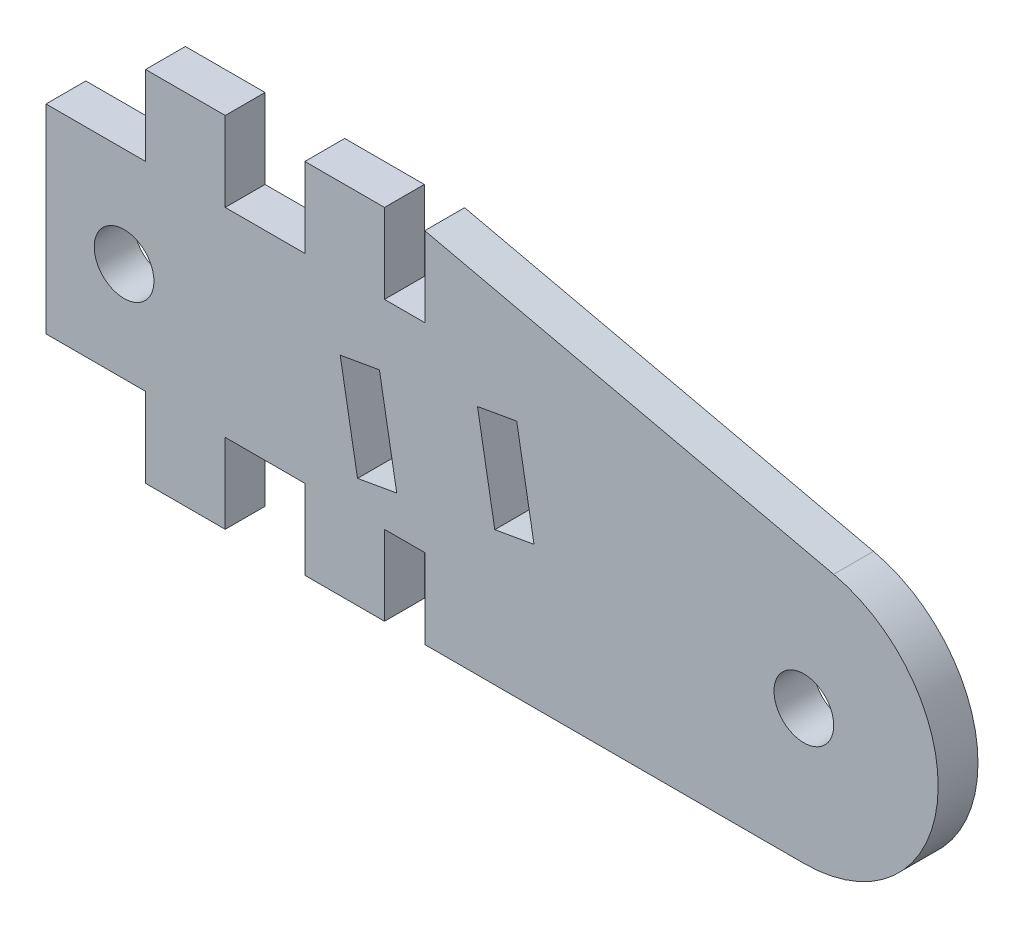
ISO-10303-21;
HEADER;
FILE_DESCRIPTION(('STEP AP214'),'2;1');
FILE_NAME('part.step','',(''),(''),'','','');
FILE_SCHEMA(('AUTOMOTIVE_DESIGN { 1 0 10303 214 1 1 1 1 }'));
ENDSEC;
DATA;
#1=APPLICATION_CONTEXT('core data for automotive mechanical design processes');
#2=APPLICATION_PROTOCOL_DEFINITION('international standard','automotive_design',2000,#1);
#3=PRODUCT_CONTEXT('',#1,'mechanical');
#4=PRODUCT('Part','Part','',(#3));
#5=PRODUCT_RELATED_PRODUCT_CATEGORY('part','',(#4));
#6=PRODUCT_DEFINITION_FORMATION('','',#4);
#7=PRODUCT_DEFINITION_CONTEXT('part definition',#1,'design');
#8=PRODUCT_DEFINITION('design','',#6,#7);
#9=PRODUCT_DEFINITION_SHAPE('','',#8);
#10=(LENGTH_UNIT() NAMED_UNIT(*) SI_UNIT(.MILLI.,.METRE.));
#11=(NAMED_UNIT(*) PLANE_ANGLE_UNIT() SI_UNIT($,.RADIAN.));
#12=(NAMED_UNIT(*) SI_UNIT($,.STERADIAN.) SOLID_ANGLE_UNIT());
#13=UNCERTAINTY_MEASURE_WITH_UNIT(LENGTH_MEASURE(1.E-05),#10,'distance_accuracy_value','');
#14=(GEOMETRIC_REPRESENTATION_CONTEXT(3) GLOBAL_UNCERTAINTY_ASSIGNED_CONTEXT((#13)) GLOBAL_UNIT_ASSIGNED_CONTEXT((#10,
#11,#12)) REPRESENTATION_CONTEXT('',''));
#15=CARTESIAN_POINT('',(0.,0.,0.));
#16=DIRECTION('',(0.,0.,1.));
#17=DIRECTION('',(1.,0.,0.));
#18=AXIS2_PLACEMENT_3D('',#15,#16,#17);
#19=CARTESIAN_POINT('',(38.05949585108,6.74534308282998,2.));
#20=DIRECTION('',(0.,0.,1.));
#21=DIRECTION('',(1.,0.,0.));
#22=AXIS2_PLACEMENT_3D('',#19,#20,#21);
#23=PLANE('',#22);
#24=CARTESIAN_POINT('',(3.92049009293526,8.99999999999998,2.));
#25=DIRECTION('',(0.,0.,1.));
#26=DIRECTION('',(1.,0.,0.));
#27=AXIS2_PLACEMENT_3D('',#24,#25,#26);
#28=CIRCLE('',#27,1.5);
#29=CARTESIAN_POINT('',(5.42049009293527,8.99999999999998,2.));
#30=VERTEX_POINT('',#29);
#31=EDGE_CURVE('E271',#30,#30,#28,.T.);
#32=ORIENTED_EDGE('',*,*,#31,.F.);
#33=EDGE_LOOP('',(#32));
#34=FACE_BOUND('',#33,.T.);
#35=DIRECTION('',(0.173648177666932,-0.984807753012208,0.));
#36=VECTOR('',#35,1.);
#37=CARTESIAN_POINT('',(14.7758795558328,10.4620193825306,2.));
#38=LINE('',#37,#36);
#39=CARTESIAN_POINT('',(14.7758795558328,10.4620193825306,2.));
#40=VERTEX_POINT('',#39);
#41=CARTESIAN_POINT('',(15.6441204441674,5.5379806174695,2.));
#42=VERTEX_POINT('',#41);
#43=EDGE_CURVE('E283',#40,#42,#38,.T.);
#44=ORIENTED_EDGE('',*,*,#43,.F.);
#45=DIRECTION('',(-0.984807753012208,-0.173648177666931,0.));
#46=VECTOR('',#45,1.);
#47=CARTESIAN_POINT('',(16.7454950618572,10.8093157378644,2.));
#48=LINE('',#47,#46);
#49=CARTESIAN_POINT('',(16.7454950618572,10.8093157378644,2.));
#50=VERTEX_POINT('',#49);
#51=EDGE_CURVE('E281',#50,#40,#48,.T.);
#52=ORIENTED_EDGE('',*,*,#51,.F.);
#53=DIRECTION('',(-0.173648177666932,0.984807753012208,0.));
#54=VECTOR('',#53,1.);
#55=CARTESIAN_POINT('',(16.7454950618572,10.8093157378644,2.));
#56=LINE('',#55,#54);
#57=CARTESIAN_POINT('',(17.6137359501918,5.88527697280338,2.));
#58=VERTEX_POINT('',#57);
#59=EDGE_CURVE('E289',#58,#50,#56,.T.);
#60=ORIENTED_EDGE('',*,*,#59,.F.);
#61=DIRECTION('',(0.984807753012206,0.173648177666941,0.));
#62=VECTOR('',#61,1.);
#63=CARTESIAN_POINT('',(15.6441204441674,5.5379806174695,2.));
#64=LINE('',#63,#62);
#65=EDGE_CURVE('E286',#42,#58,#64,.T.);
#66=ORIENTED_EDGE('',*,*,#65,.F.);
#67=EDGE_LOOP('',(#44,#52,#60,#66));
#68=FACE_BOUND('',#67,.T.);
#69=DIRECTION('',(0.,1.,0.));
#70=VECTOR('',#69,1.);
#71=CARTESIAN_POINT('',(9.,0.,2.));
#72=LINE('',#71,#70);
#73=CARTESIAN_POINT('',(9.,0.,2.));
#74=VERTEX_POINT('',#73);
#75=CARTESIAN_POINT('',(9.,4.,2.));
#76=VERTEX_POINT('',#75);
#77=EDGE_CURVE('E312',#74,#76,#72,.T.);
#78=ORIENTED_EDGE('',*,*,#77,.T.);
#79=DIRECTION('',(1.,0.,0.));
#80=VECTOR('',#79,1.);
#81=CARTESIAN_POINT('',(9.,4.,2.));
#82=LINE('',#81,#80);
#83=CARTESIAN_POINT('',(13.,4.,2.));
#84=VERTEX_POINT('',#83);
#85=EDGE_CURVE('E315',#76,#84,#82,.T.);
#86=ORIENTED_EDGE('',*,*,#85,.T.);
#87=DIRECTION('',(0.,-1.,0.));
#88=VECTOR('',#87,1.);
#89=CARTESIAN_POINT('',(13.,4.,2.));
#90=LINE('',#89,#88);
#91=CARTESIAN_POINT('',(13.,0.,2.));
#92=VERTEX_POINT('',#91);
#93=EDGE_CURVE('E318',#84,#92,#90,.T.);
#94=ORIENTED_EDGE('',*,*,#93,.T.);
#95=DIRECTION('',(1.,0.,0.));
#96=VECTOR('',#95,1.);
#97=CARTESIAN_POINT('',(13.,0.,2.));
#98=LINE('',#97,#96);
#99=CARTESIAN_POINT('',(17.,0.,2.));
#100=VERTEX_POINT('',#99);
#101=EDGE_CURVE('E320',#92,#100,#98,.T.);
#102=ORIENTED_EDGE('',*,*,#101,.T.);
#103=DIRECTION('',(0.,1.,0.));
#104=VECTOR('',#103,1.);
#105=CARTESIAN_POINT('',(17.,0.,2.));
#106=LINE('',#105,#104);
#107=CARTESIAN_POINT('',(17.,4.,2.));
#108=VERTEX_POINT('',#107);
#109=EDGE_CURVE('E322',#100,#108,#106,.T.);
#110=ORIENTED_EDGE('',*,*,#109,.T.);
#111=DIRECTION('',(1.,0.,0.));
#112=VECTOR('',#111,1.);
#113=CARTESIAN_POINT('',(17.,4.,2.));
#114=LINE('',#113,#112);
#115=CARTESIAN_POINT('',(19.0215619335038,4.,2.));
#116=VERTEX_POINT('',#115);
#117=EDGE_CURVE('E324',#108,#116,#114,.T.);
#118=ORIENTED_EDGE('',*,*,#117,.T.);
#119=DIRECTION('',(0.,-1.,0.));
#120=VECTOR('',#119,1.);
#121=CARTESIAN_POINT('',(19.0215619335038,4.,2.));
#122=LINE('',#121,#120);
#123=CARTESIAN_POINT('',(19.0215619335038,0.,2.));
#124=VERTEX_POINT('',#123);
#125=EDGE_CURVE('E326',#116,#124,#122,.T.);
#126=ORIENTED_EDGE('',*,*,#125,.T.);
#127=DIRECTION('',(1.,0.,0.));
#128=VECTOR('',#127,1.);
#129=CARTESIAN_POINT('',(19.0215619335038,0.,2.));
#130=LINE('',#129,#128);
#131=CARTESIAN_POINT('',(38.05949585108,0.,2.));
#132=VERTEX_POINT('',#131);
#133=EDGE_CURVE('E328',#124,#132,#130,.T.);
#134=ORIENTED_EDGE('',*,*,#133,.T.);
#135=CARTESIAN_POINT('',(38.05949585108,6.74534308282998,2.));
#136=DIRECTION('',(0.,0.,1.));
#137=DIRECTION('',(1.,0.,0.));
#138=AXIS2_PLACEMENT_3D('',#135,#136,#137);
#139=CIRCLE('',#138,6.74534308282998);
#140=CARTESIAN_POINT('',(39.5575990260467,13.3222222958182,2.));
#141=VERTEX_POINT('',#140);
#142=EDGE_CURVE('E330',#132,#141,#139,.T.);
#143=ORIENTED_EDGE('',*,*,#142,.T.);
#144=DIRECTION('',(-0.97502515916936,0.22209443709099,0.));
#145=VECTOR('',#144,1.);
#146=CARTESIAN_POINT('',(19.0215619335039,17.9999883567818,2.));
#147=LINE('',#146,#145);
#148=CARTESIAN_POINT('',(19.0215619335039,17.9999883567818,2.));
#149=VERTEX_POINT('',#148);
#150=EDGE_CURVE('E332',#141,#149,#147,.T.);
#151=ORIENTED_EDGE('',*,*,#150,.T.);
#152=DIRECTION('',(0.,-1.,0.));
#153=VECTOR('',#152,1.);
#154=CARTESIAN_POINT('',(19.0215619335038,13.9999883567817,2.));
#155=LINE('',#154,#153);
#156=CARTESIAN_POINT('',(19.0215619335038,13.9999883567817,2.));
#157=VERTEX_POINT('',#156);
#158=EDGE_CURVE('E334',#149,#157,#155,.T.);
#159=ORIENTED_EDGE('',*,*,#158,.T.);
#160=DIRECTION('',(-1.,0.,0.));
#161=VECTOR('',#160,1.);
#162=CARTESIAN_POINT('',(17.,13.9999883567817,2.));
#163=LINE('',#162,#161);
#164=CARTESIAN_POINT('',(17.,13.9999883567817,2.));
#165=VERTEX_POINT('',#164);
#166=EDGE_CURVE('E336',#157,#165,#163,.T.);
#167=ORIENTED_EDGE('',*,*,#166,.T.);
#168=DIRECTION('',(0.,1.,0.));
#169=VECTOR('',#168,1.);
#170=CARTESIAN_POINT('',(17.,17.9999883567817,2.));
#171=LINE('',#170,#169);
#172=CARTESIAN_POINT('',(17.,17.9999883567817,2.));
#173=VERTEX_POINT('',#172);
#174=EDGE_CURVE('E338',#165,#173,#171,.T.);
#175=ORIENTED_EDGE('',*,*,#174,.T.);
#176=DIRECTION('',(-1.,0.,0.));
#177=VECTOR('',#176,1.);
#178=CARTESIAN_POINT('',(13.,17.9999883567817,2.));
#179=LINE('',#178,#177);
#180=CARTESIAN_POINT('',(13.,17.9999883567817,2.));
#181=VERTEX_POINT('',#180);
#182=EDGE_CURVE('E340',#173,#181,#179,.T.);
#183=ORIENTED_EDGE('',*,*,#182,.T.);
#184=DIRECTION('',(0.,-1.,0.));
#185=VECTOR('',#184,1.);
#186=CARTESIAN_POINT('',(13.,13.9999883567817,2.));
#187=LINE('',#186,#185);
#188=CARTESIAN_POINT('',(13.,13.9999883567817,2.));
#189=VERTEX_POINT('',#188);
#190=EDGE_CURVE('E342',#181,#189,#187,.T.);
#191=ORIENTED_EDGE('',*,*,#190,.T.);
#192=DIRECTION('',(-1.,0.,0.));
#193=VECTOR('',#192,1.);
#194=CARTESIAN_POINT('',(9.,13.9999883567817,2.));
#195=LINE('',#194,#193);
#196=CARTESIAN_POINT('',(9.,13.9999883567817,2.));
#197=VERTEX_POINT('',#196);
#198=EDGE_CURVE('E344',#189,#197,#195,.T.);
#199=ORIENTED_EDGE('',*,*,#198,.T.);
#200=DIRECTION('',(0.,1.,0.));
#201=VECTOR('',#200,1.);
#202=CARTESIAN_POINT('',(9.,17.9999883567817,2.));
#203=LINE('',#202,#201);
#204=CARTESIAN_POINT('',(9.,17.9999883567817,2.));
#205=VERTEX_POINT('',#204);
#206=EDGE_CURVE('E346',#197,#205,#203,.T.);
#207=ORIENTED_EDGE('',*,*,#206,.T.);
#208=DIRECTION('',(-1.,0.,0.));
#209=VECTOR('',#208,1.);
#210=CARTESIAN_POINT('',(5.,17.9999883567817,2.));
#211=LINE('',#210,#209);
#212=CARTESIAN_POINT('',(5.,17.9999883567817,2.));
#213=VERTEX_POINT('',#212);
#214=EDGE_CURVE('E348',#205,#213,#211,.T.);
#215=ORIENTED_EDGE('',*,*,#214,.T.);
#216=DIRECTION('',(0.,-1.,0.));
#217=VECTOR('',#216,1.);
#218=CARTESIAN_POINT('',(5.,13.9999883567817,2.));
#219=LINE('',#218,#217);
#220=CARTESIAN_POINT('',(5.,13.9999883567817,2.));
#221=VERTEX_POINT('',#220);
#222=EDGE_CURVE('E350',#213,#221,#219,.T.);
#223=ORIENTED_EDGE('',*,*,#222,.T.);
#224=DIRECTION('',(-1.,0.,0.));
#225=VECTOR('',#224,1.);
#226=CARTESIAN_POINT('',(5.,13.9999883567817,2.));
#227=LINE('',#226,#225);
#228=CARTESIAN_POINT('',(0.,13.9999883567817,2.));
#229=VERTEX_POINT('',#228);
#230=EDGE_CURVE('E352',#221,#229,#227,.T.);
#231=ORIENTED_EDGE('',*,*,#230,.T.);
#232=DIRECTION('',(0.,-1.,0.));
#233=VECTOR('',#232,1.);
#234=CARTESIAN_POINT('',(0.,13.9999883567817,2.));
#235=LINE('',#234,#233);
#236=CARTESIAN_POINT('',(0.,4.,2.));
#237=VERTEX_POINT('',#236);
#238=EDGE_CURVE('E354',#229,#237,#235,.T.);
#239=ORIENTED_EDGE('',*,*,#238,.T.);
#240=DIRECTION('',(1.,0.,0.));
#241=VECTOR('',#240,1.);
#242=CARTESIAN_POINT('',(0.,4.,2.));
#243=LINE('',#242,#241);
#244=CARTESIAN_POINT('',(5.,4.,2.));
#245=VERTEX_POINT('',#244);
#246=EDGE_CURVE('E356',#237,#245,#243,.T.);
#247=ORIENTED_EDGE('',*,*,#246,.T.);
#248=DIRECTION('',(0.,-1.,0.));
#249=VECTOR('',#248,1.);
#250=CARTESIAN_POINT('',(5.,4.,2.));
#251=LINE('',#250,#249);
#252=CARTESIAN_POINT('',(5.,0.,2.));
#253=VERTEX_POINT('',#252);
#254=EDGE_CURVE('E358',#245,#253,#251,.T.);
#255=ORIENTED_EDGE('',*,*,#254,.T.);
#256=DIRECTION('',(1.,0.,0.));
#257=VECTOR('',#256,1.);
#258=CARTESIAN_POINT('',(5.,0.,2.));
#259=LINE('',#258,#257);
#260=EDGE_CURVE('E360',#253,#74,#259,.T.);
#261=ORIENTED_EDGE('',*,*,#260,.T.);
#262=EDGE_LOOP('',(#78,#86,#94,#102,#110,#118,#126,#134,#143,#151,#159,#167,#175,#183,#191,#199,
#207,#215,#223,#231,#239,#247,#255,#261));
#263=FACE_BOUND('',#262,.T.);
#264=DIRECTION('',(-0.984807753012208,-0.173648177666933,0.));
#265=VECTOR('',#264,1.);
#266=CARTESIAN_POINT('',(23.6391493329428,12.024852981533,2.));
#267=LINE('',#266,#265);
#268=CARTESIAN_POINT('',(23.6391493329428,12.024852981533,2.));
#269=VERTEX_POINT('',#268);
#270=CARTESIAN_POINT('',(21.6695338269183,11.6775566261991,2.));
#271=VERTEX_POINT('',#270);
#272=EDGE_CURVE('E250',#269,#271,#267,.T.);
#273=ORIENTED_EDGE('',*,*,#272,.F.);
#274=DIRECTION('',(-0.173648177666932,0.984807753012208,0.));
#275=VECTOR('',#274,1.);
#276=CARTESIAN_POINT('',(23.6391493329428,12.024852981533,2.));
#277=LINE('',#276,#275);
#278=CARTESIAN_POINT('',(24.5073902212774,7.10081421647191,2.));
#279=VERTEX_POINT('',#278);
#280=EDGE_CURVE('E242',#279,#269,#277,.T.);
#281=ORIENTED_EDGE('',*,*,#280,.F.);
#282=DIRECTION('',(0.984807753012208,0.173648177666932,0.));
#283=VECTOR('',#282,1.);
#284=CARTESIAN_POINT('',(22.537774715253,6.75351786113804,2.));
#285=LINE('',#284,#283);
#286=CARTESIAN_POINT('',(22.537774715253,6.75351786113804,2.));
#287=VERTEX_POINT('',#286);
#288=EDGE_CURVE('E265',#287,#279,#285,.T.);
#289=ORIENTED_EDGE('',*,*,#288,.F.);
#290=DIRECTION('',(0.173648177666932,-0.984807753012208,0.));
#291=VECTOR('',#290,1.);
#292=CARTESIAN_POINT('',(21.6695338269183,11.6775566261991,2.));
#293=LINE('',#292,#291);
#294=EDGE_CURVE('E263',#271,#287,#293,.T.);
#295=ORIENTED_EDGE('',*,*,#294,.F.);
#296=EDGE_LOOP('',(#273,#281,#289,#295));
#297=FACE_BOUND('',#296,.T.);
#298=CARTESIAN_POINT('',(38.05949585108,6.74534308282998,2.));
#299=DIRECTION('',(0.,0.,1.));
#300=DIRECTION('',(1.,0.,0.));
#301=AXIS2_PLACEMENT_3D('',#298,#299,#300);
#302=CIRCLE('',#301,1.5);
#303=CARTESIAN_POINT('',(39.55949585108,6.74534308282998,2.));
#304=VERTEX_POINT('',#303);
#305=EDGE_CURVE('E904',#304,#304,#302,.T.);
#306=ORIENTED_EDGE('',*,*,#305,.F.);
#307=EDGE_LOOP('',(#306));
#308=FACE_BOUND('',#307,.T.);
#309=ADVANCED_FACE('F33',(#34,#68,#263,#297,#308),#23,.T.);
#310=CARTESIAN_POINT('',(38.05949585108,6.74534308282998,0.));
#311=DIRECTION('',(0.,0.,1.));
#312=DIRECTION('',(1.,0.,0.));
#313=AXIS2_PLACEMENT_3D('',#310,#311,#312);
#314=PLANE('',#313);
#315=CARTESIAN_POINT('',(3.92049009293526,8.99999999999998,0.));
#316=DIRECTION('',(0.,0.,1.));
#317=DIRECTION('',(1.,0.,0.));
#318=AXIS2_PLACEMENT_3D('',#315,#316,#317);
#319=CIRCLE('',#318,1.5);
#320=CARTESIAN_POINT('',(5.42049009293527,8.99999999999998,0.));
#321=VERTEX_POINT('',#320);
#322=EDGE_CURVE('E910',#321,#321,#319,.T.);
#323=ORIENTED_EDGE('',*,*,#322,.T.);
#324=EDGE_LOOP('',(#323));
#325=FACE_BOUND('',#324,.T.);
#326=DIRECTION('',(-0.984807753012208,-0.173648177666931,0.));
#327=VECTOR('',#326,1.);
#328=CARTESIAN_POINT('',(16.7454950618572,10.8093157378644,0.));
#329=LINE('',#328,#327);
#330=CARTESIAN_POINT('',(16.7454950618572,10.8093157378644,0.));
#331=VERTEX_POINT('',#330);
#332=CARTESIAN_POINT('',(14.7758795558328,10.4620193825306,0.));
#333=VERTEX_POINT('',#332);
#334=EDGE_CURVE('E258',#331,#333,#329,.T.);
#335=ORIENTED_EDGE('',*,*,#334,.T.);
#336=DIRECTION('',(0.173648177666932,-0.984807753012208,0.));
#337=VECTOR('',#336,1.);
#338=CARTESIAN_POINT('',(14.7758795558328,10.4620193825306,0.));
#339=LINE('',#338,#337);
#340=CARTESIAN_POINT('',(15.6441204441674,5.5379806174695,0.));
#341=VERTEX_POINT('',#340);
#342=EDGE_CURVE('E294',#333,#341,#339,.T.);
#343=ORIENTED_EDGE('',*,*,#342,.T.);
#344=DIRECTION('',(0.984807753012206,0.173648177666941,0.));
#345=VECTOR('',#344,1.);
#346=CARTESIAN_POINT('',(15.6441204441674,5.5379806174695,0.));
#347=LINE('',#346,#345);
#348=CARTESIAN_POINT('',(17.6137359501918,5.88527697280338,0.));
#349=VERTEX_POINT('',#348);
#350=EDGE_CURVE('E297',#341,#349,#347,.T.);
#351=ORIENTED_EDGE('',*,*,#350,.T.);
#352=DIRECTION('',(-0.173648177666932,0.984807753012208,0.));
#353=VECTOR('',#352,1.);
#354=CARTESIAN_POINT('',(16.7454950618572,10.8093157378644,0.));
#355=LINE('',#354,#353);
#356=EDGE_CURVE('E284',#349,#331,#355,.T.);
#357=ORIENTED_EDGE('',*,*,#356,.T.);
#358=EDGE_LOOP('',(#335,#343,#351,#357));
#359=FACE_BOUND('',#358,.T.);
#360=DIRECTION('',(0.,1.,0.));
#361=VECTOR('',#360,1.);
#362=CARTESIAN_POINT('',(9.,0.,0.));
#363=LINE('',#362,#361);
#364=CARTESIAN_POINT('',(9.,0.,0.));
#365=VERTEX_POINT('',#364);
#366=CARTESIAN_POINT('',(9.,4.,0.));
#367=VERTEX_POINT('',#366);
#368=EDGE_CURVE('E311',#365,#367,#363,.T.);
#369=ORIENTED_EDGE('',*,*,#368,.F.);
#370=DIRECTION('',(1.,0.,0.));
#371=VECTOR('',#370,1.);
#372=CARTESIAN_POINT('',(5.,0.,0.));
#373=LINE('',#372,#371);
#374=CARTESIAN_POINT('',(5.,0.,0.));
#375=VERTEX_POINT('',#374);
#376=EDGE_CURVE('E316',#375,#365,#373,.T.);
#377=ORIENTED_EDGE('',*,*,#376,.F.);
#378=DIRECTION('',(0.,-1.,0.));
#379=VECTOR('',#378,1.);
#380=CARTESIAN_POINT('',(5.,4.,0.));
#381=LINE('',#380,#379);
#382=CARTESIAN_POINT('',(5.,4.,0.));
#383=VERTEX_POINT('',#382);
#384=EDGE_CURVE('E407',#383,#375,#381,.T.);
#385=ORIENTED_EDGE('',*,*,#384,.F.);
#386=DIRECTION('',(1.,0.,0.));
#387=VECTOR('',#386,1.);
#388=CARTESIAN_POINT('',(0.,4.,0.));
#389=LINE('',#388,#387);
#390=CARTESIAN_POINT('',(0.,4.,0.));
#391=VERTEX_POINT('',#390);
#392=EDGE_CURVE('E405',#391,#383,#389,.T.);
#393=ORIENTED_EDGE('',*,*,#392,.F.);
#394=DIRECTION('',(0.,-1.,0.));
#395=VECTOR('',#394,1.);
#396=CARTESIAN_POINT('',(0.,13.9999883567817,0.));
#397=LINE('',#396,#395);
#398=CARTESIAN_POINT('',(0.,13.9999883567817,0.));
#399=VERTEX_POINT('',#398);
#400=EDGE_CURVE('E403',#399,#391,#397,.T.);
#401=ORIENTED_EDGE('',*,*,#400,.F.);
#402=DIRECTION('',(-1.,0.,0.));
#403=VECTOR('',#402,1.);
#404=CARTESIAN_POINT('',(5.,13.9999883567817,0.));
#405=LINE('',#404,#403);
#406=CARTESIAN_POINT('',(5.,13.9999883567817,0.));
#407=VERTEX_POINT('',#406);
#408=EDGE_CURVE('E401',#407,#399,#405,.T.);
#409=ORIENTED_EDGE('',*,*,#408,.F.);
#410=DIRECTION('',(0.,-1.,0.));
#411=VECTOR('',#410,1.);
#412=CARTESIAN_POINT('',(5.,13.9999883567817,0.));
#413=LINE('',#412,#411);
#414=CARTESIAN_POINT('',(5.,17.9999883567817,0.));
#415=VERTEX_POINT('',#414);
#416=EDGE_CURVE('E399',#415,#407,#413,.T.);
#417=ORIENTED_EDGE('',*,*,#416,.F.);
#418=DIRECTION('',(-1.,0.,0.));
#419=VECTOR('',#418,1.);
#420=CARTESIAN_POINT('',(5.,17.9999883567817,0.));
#421=LINE('',#420,#419);
#422=CARTESIAN_POINT('',(9.,17.9999883567817,0.));
#423=VERTEX_POINT('',#422);
#424=EDGE_CURVE('E397',#423,#415,#421,.T.);
#425=ORIENTED_EDGE('',*,*,#424,.F.);
#426=DIRECTION('',(0.,1.,0.));
#427=VECTOR('',#426,1.);
#428=CARTESIAN_POINT('',(9.,17.9999883567817,0.));
#429=LINE('',#428,#427);
#430=CARTESIAN_POINT('',(9.,13.9999883567817,0.));
#431=VERTEX_POINT('',#430);
#432=EDGE_CURVE('E395',#431,#423,#429,.T.);
#433=ORIENTED_EDGE('',*,*,#432,.F.);
#434=DIRECTION('',(-1.,0.,0.));
#435=VECTOR('',#434,1.);
#436=CARTESIAN_POINT('',(9.,13.9999883567817,0.));
#437=LINE('',#436,#435);
#438=CARTESIAN_POINT('',(13.,13.9999883567817,0.));
#439=VERTEX_POINT('',#438);
#440=EDGE_CURVE('E393',#439,#431,#437,.T.);
#441=ORIENTED_EDGE('',*,*,#440,.F.);
#442=DIRECTION('',(0.,-1.,0.));
#443=VECTOR('',#442,1.);
#444=CARTESIAN_POINT('',(13.,13.9999883567817,0.));
#445=LINE('',#444,#443);
#446=CARTESIAN_POINT('',(13.,17.9999883567817,0.));
#447=VERTEX_POINT('',#446);
#448=EDGE_CURVE('E391',#447,#439,#445,.T.);
#449=ORIENTED_EDGE('',*,*,#448,.F.);
#450=DIRECTION('',(-1.,0.,0.));
#451=VECTOR('',#450,1.);
#452=CARTESIAN_POINT('',(13.,17.9999883567817,0.));
#453=LINE('',#452,#451);
#454=CARTESIAN_POINT('',(17.,17.9999883567817,0.));
#455=VERTEX_POINT('',#454);
#456=EDGE_CURVE('E389',#455,#447,#453,.T.);
#457=ORIENTED_EDGE('',*,*,#456,.F.);
#458=DIRECTION('',(0.,1.,0.));
#459=VECTOR('',#458,1.);
#460=CARTESIAN_POINT('',(17.,17.9999883567817,0.));
#461=LINE('',#460,#459);
#462=CARTESIAN_POINT('',(17.,13.9999883567817,0.));
#463=VERTEX_POINT('',#462);
#464=EDGE_CURVE('E387',#463,#455,#461,.T.);
#465=ORIENTED_EDGE('',*,*,#464,.F.);
#466=DIRECTION('',(-1.,0.,0.));
#467=VECTOR('',#466,1.);
#468=CARTESIAN_POINT('',(17.,13.9999883567817,0.));
#469=LINE('',#468,#467);
#470=CARTESIAN_POINT('',(19.0215619335038,13.9999883567817,0.));
#471=VERTEX_POINT('',#470);
#472=EDGE_CURVE('E385',#471,#463,#469,.T.);
#473=ORIENTED_EDGE('',*,*,#472,.F.);
#474=DIRECTION('',(0.,-1.,0.));
#475=VECTOR('',#474,1.);
#476=CARTESIAN_POINT('',(19.0215619335038,13.9999883567817,0.));
#477=LINE('',#476,#475);
#478=CARTESIAN_POINT('',(19.0215619335039,17.9999883567818,0.));
#479=VERTEX_POINT('',#478);
#480=EDGE_CURVE('E383',#479,#471,#477,.T.);
#481=ORIENTED_EDGE('',*,*,#480,.F.);
#482=DIRECTION('',(-0.97502515916936,0.22209443709099,0.));
#483=VECTOR('',#482,1.);
#484=CARTESIAN_POINT('',(19.0215619335039,17.9999883567818,0.));
#485=LINE('',#484,#483);
#486=CARTESIAN_POINT('',(39.5575990260467,13.3222222958182,0.));
#487=VERTEX_POINT('',#486);
#488=EDGE_CURVE('E381',#487,#479,#485,.T.);
#489=ORIENTED_EDGE('',*,*,#488,.F.);
#490=CARTESIAN_POINT('',(38.05949585108,6.74534308282998,0.));
#491=DIRECTION('',(0.,0.,1.));
#492=DIRECTION('',(1.,0.,0.));
#493=AXIS2_PLACEMENT_3D('',#490,#491,#492);
#494=CIRCLE('',#493,6.74534308282998);
#495=CARTESIAN_POINT('',(38.05949585108,0.,0.));
#496=VERTEX_POINT('',#495);
#497=EDGE_CURVE('E379',#496,#487,#494,.T.);
#498=ORIENTED_EDGE('',*,*,#497,.F.);
#499=DIRECTION('',(1.,0.,0.));
#500=VECTOR('',#499,1.);
#501=CARTESIAN_POINT('',(19.0215619335038,0.,0.));
#502=LINE('',#501,#500);
#503=CARTESIAN_POINT('',(19.0215619335038,0.,0.));
#504=VERTEX_POINT('',#503);
#505=EDGE_CURVE('E377',#504,#496,#502,.T.);
#506=ORIENTED_EDGE('',*,*,#505,.F.);
#507=DIRECTION('',(0.,-1.,0.));
#508=VECTOR('',#507,1.);
#509=CARTESIAN_POINT('',(19.0215619335038,4.,0.));
#510=LINE('',#509,#508);
#511=CARTESIAN_POINT('',(19.0215619335038,4.,0.));
#512=VERTEX_POINT('',#511);
#513=EDGE_CURVE('E375',#512,#504,#510,.T.);
#514=ORIENTED_EDGE('',*,*,#513,.F.);
#515=DIRECTION('',(1.,0.,0.));
#516=VECTOR('',#515,1.);
#517=CARTESIAN_POINT('',(17.,4.,0.));
#518=LINE('',#517,#516);
#519=CARTESIAN_POINT('',(17.,4.,0.));
#520=VERTEX_POINT('',#519);
#521=EDGE_CURVE('E373',#520,#512,#518,.T.);
#522=ORIENTED_EDGE('',*,*,#521,.F.);
#523=DIRECTION('',(0.,1.,0.));
#524=VECTOR('',#523,1.);
#525=CARTESIAN_POINT('',(17.,0.,0.));
#526=LINE('',#525,#524);
#527=CARTESIAN_POINT('',(17.,0.,0.));
#528=VERTEX_POINT('',#527);
#529=EDGE_CURVE('E371',#528,#520,#526,.T.);
#530=ORIENTED_EDGE('',*,*,#529,.F.);
#531=DIRECTION('',(1.,0.,0.));
#532=VECTOR('',#531,1.);
#533=CARTESIAN_POINT('',(13.,0.,0.));
#534=LINE('',#533,#532);
#535=CARTESIAN_POINT('',(13.,0.,0.));
#536=VERTEX_POINT('',#535);
#537=EDGE_CURVE('E369',#536,#528,#534,.T.);
#538=ORIENTED_EDGE('',*,*,#537,.F.);
#539=DIRECTION('',(0.,-1.,0.));
#540=VECTOR('',#539,1.);
#541=CARTESIAN_POINT('',(13.,4.,0.));
#542=LINE('',#541,#540);
#543=CARTESIAN_POINT('',(13.,4.,0.));
#544=VERTEX_POINT('',#543);
#545=EDGE_CURVE('E367',#544,#536,#542,.T.);
#546=ORIENTED_EDGE('',*,*,#545,.F.);
#547=DIRECTION('',(1.,0.,0.));
#548=VECTOR('',#547,1.);
#549=CARTESIAN_POINT('',(9.,4.,0.));
#550=LINE('',#549,#548);
#551=EDGE_CURVE('E365',#367,#544,#550,.T.);
#552=ORIENTED_EDGE('',*,*,#551,.F.);
#553=EDGE_LOOP('',(#369,#377,#385,#393,#401,#409,#417,#425,#433,#441,#449,#457,#465,#473,#481,
#489,#498,#506,#514,#522,#530,#538,#546,#552));
#554=FACE_BOUND('',#553,.T.);
#555=DIRECTION('',(-0.173648177666932,0.984807753012208,0.));
#556=VECTOR('',#555,1.);
#557=CARTESIAN_POINT('',(23.6391493329428,12.024852981533,0.));
#558=LINE('',#557,#556);
#559=CARTESIAN_POINT('',(24.5073902212774,7.10081421647191,0.));
#560=VERTEX_POINT('',#559);
#561=CARTESIAN_POINT('',(23.6391493329428,12.024852981533,0.));
#562=VERTEX_POINT('',#561);
#563=EDGE_CURVE('E56',#560,#562,#558,.T.);
#564=ORIENTED_EDGE('',*,*,#563,.T.);
#565=DIRECTION('',(-0.984807753012208,-0.173648177666933,0.));
#566=VECTOR('',#565,1.);
#567=CARTESIAN_POINT('',(23.6391493329428,12.024852981533,0.));
#568=LINE('',#567,#566);
#569=CARTESIAN_POINT('',(21.6695338269183,11.6775566261991,0.));
#570=VERTEX_POINT('',#569);
#571=EDGE_CURVE('E257',#562,#570,#568,.T.);
#572=ORIENTED_EDGE('',*,*,#571,.T.);
#573=DIRECTION('',(0.173648177666932,-0.984807753012208,0.));
#574=VECTOR('',#573,1.);
#575=CARTESIAN_POINT('',(21.6695338269183,11.6775566261991,0.));
#576=LINE('',#575,#574);
#577=CARTESIAN_POINT('',(22.537774715253,6.75351786113804,0.));
#578=VERTEX_POINT('',#577);
#579=EDGE_CURVE('E273',#570,#578,#576,.T.);
#580=ORIENTED_EDGE('',*,*,#579,.T.);
#581=DIRECTION('',(0.984807753012208,0.173648177666932,0.));
#582=VECTOR('',#581,1.);
#583=CARTESIAN_POINT('',(22.537774715253,6.75351786113804,0.));
#584=LINE('',#583,#582);
#585=EDGE_CURVE('E251',#578,#560,#584,.T.);
#586=ORIENTED_EDGE('',*,*,#585,.T.);
#587=EDGE_LOOP('',(#564,#572,#580,#586));
#588=FACE_BOUND('',#587,.T.);
#589=CARTESIAN_POINT('',(38.05949585108,6.74534308282998,0.));
#590=DIRECTION('',(0.,0.,1.));
#591=DIRECTION('',(1.,0.,0.));
#592=AXIS2_PLACEMENT_3D('',#589,#590,#591);
#593=CIRCLE('',#592,1.5);
#594=CARTESIAN_POINT('',(39.55949585108,6.74534308282998,0.));
#595=VERTEX_POINT('',#594);
#596=EDGE_CURVE('E907',#595,#595,#593,.T.);
#597=ORIENTED_EDGE('',*,*,#596,.T.);
#598=EDGE_LOOP('',(#597));
#599=FACE_BOUND('',#598,.T.);
#600=ADVANCED_FACE('F485',(#325,#359,#554,#588,#599),#314,.F.);
#601=CARTESIAN_POINT('',(9.,0.,2.));
#602=DIRECTION('',(-1.,0.,0.));
#603=DIRECTION('',(0.,0.,1.));
#604=AXIS2_PLACEMENT_3D('',#601,#602,#603);
#605=PLANE('',#604);
#606=ORIENTED_EDGE('',*,*,#368,.T.);
#607=DIRECTION('',(0.,0.,-1.));
#608=VECTOR('',#607,1.);
#609=CARTESIAN_POINT('',(9.,4.,2.));
#610=LINE('',#609,#608);
#611=EDGE_CURVE('E11',#76,#367,#610,.T.);
#612=ORIENTED_EDGE('',*,*,#611,.F.);
#613=ORIENTED_EDGE('',*,*,#77,.F.);
#614=DIRECTION('',(0.,0.,-1.));
#615=VECTOR('',#614,1.);
#616=CARTESIAN_POINT('',(9.,0.,2.));
#617=LINE('',#616,#615);
#618=EDGE_CURVE('E362',#74,#365,#617,.T.);
#619=ORIENTED_EDGE('',*,*,#618,.T.);
#620=EDGE_LOOP('',(#606,#612,#613,#619));
#621=FACE_BOUND('',#620,.T.);
#622=ADVANCED_FACE('F35',(#621),#605,.F.);
#623=CARTESIAN_POINT('',(9.,4.,2.));
#624=DIRECTION('',(0.,1.,0.));
#625=DIRECTION('',(0.,0.,1.));
#626=AXIS2_PLACEMENT_3D('',#623,#624,#625);
#627=PLANE('',#626);
#628=ORIENTED_EDGE('',*,*,#551,.T.);
#629=DIRECTION('',(0.,0.,-1.));
#630=VECTOR('',#629,1.);
#631=CARTESIAN_POINT('',(13.,4.,2.));
#632=LINE('',#631,#630);
#633=EDGE_CURVE('E41',#84,#544,#632,.T.);
#634=ORIENTED_EDGE('',*,*,#633,.F.);
#635=ORIENTED_EDGE('',*,*,#85,.F.);
#636=ORIENTED_EDGE('',*,*,#611,.T.);
#637=EDGE_LOOP('',(#628,#634,#635,#636));
#638=FACE_BOUND('',#637,.T.);
#639=ADVANCED_FACE('F502',(#638),#627,.F.);
#640=CARTESIAN_POINT('',(13.,4.,2.));
#641=DIRECTION('',(1.,0.,0.));
#642=DIRECTION('',(0.,1.,0.));
#643=AXIS2_PLACEMENT_3D('',#640,#641,#642);
#644=PLANE('',#643);
#645=ORIENTED_EDGE('',*,*,#545,.T.);
#646=DIRECTION('',(0.,0.,-1.));
#647=VECTOR('',#646,1.);
#648=CARTESIAN_POINT('',(13.,0.,2.));
#649=LINE('',#648,#647);
#650=EDGE_CURVE('E472',#92,#536,#649,.T.);
#651=ORIENTED_EDGE('',*,*,#650,.F.);
#652=ORIENTED_EDGE('',*,*,#93,.F.);
#653=ORIENTED_EDGE('',*,*,#633,.T.);
#654=EDGE_LOOP('',(#645,#651,#652,#653));
#655=FACE_BOUND('',#654,.T.);
#656=ADVANCED_FACE('F479',(#655),#644,.F.);
#657=CARTESIAN_POINT('',(13.,0.,2.));
#658=DIRECTION('',(0.,1.,0.));
#659=DIRECTION('',(-1.,0.,0.));
#660=AXIS2_PLACEMENT_3D('',#657,#658,#659);
#661=PLANE('',#660);
#662=ORIENTED_EDGE('',*,*,#537,.T.);
#663=DIRECTION('',(0.,0.,-1.));
#664=VECTOR('',#663,1.);
#665=CARTESIAN_POINT('',(17.,0.,2.));
#666=LINE('',#665,#664);
#667=EDGE_CURVE('E469',#100,#528,#666,.T.);
#668=ORIENTED_EDGE('',*,*,#667,.F.);
#669=ORIENTED_EDGE('',*,*,#101,.F.);
#670=ORIENTED_EDGE('',*,*,#650,.T.);
#671=EDGE_LOOP('',(#662,#668,#669,#670));
#672=FACE_BOUND('',#671,.T.);
#673=ADVANCED_FACE('F491',(#672),#661,.F.);
#674=CARTESIAN_POINT('',(17.,0.,2.));
#675=DIRECTION('',(-1.,0.,0.));
#676=DIRECTION('',(0.,0.,1.));
#677=AXIS2_PLACEMENT_3D('',#674,#675,#676);
#678=PLANE('',#677);
#679=ORIENTED_EDGE('',*,*,#529,.T.);
#680=DIRECTION('',(0.,0.,-1.));
#681=VECTOR('',#680,1.);
#682=CARTESIAN_POINT('',(17.,4.,2.));
#683=LINE('',#682,#681);
#684=EDGE_CURVE('E466',#108,#520,#683,.T.);
#685=ORIENTED_EDGE('',*,*,#684,.F.);
#686=ORIENTED_EDGE('',*,*,#109,.F.);
#687=ORIENTED_EDGE('',*,*,#667,.T.);
#688=EDGE_LOOP('',(#679,#685,#686,#687));
#689=FACE_BOUND('',#688,.T.);
#690=ADVANCED_FACE('F495',(#689),#678,.F.);
#691=CARTESIAN_POINT('',(17.,4.,2.));
#692=DIRECTION('',(0.,1.,0.));
#693=DIRECTION('',(0.,0.,1.));
#694=AXIS2_PLACEMENT_3D('',#691,#692,#693);
#695=PLANE('',#694);
#696=ORIENTED_EDGE('',*,*,#521,.T.);
#697=DIRECTION('',(0.,0.,-1.));
#698=VECTOR('',#697,1.);
#699=CARTESIAN_POINT('',(19.0215619335038,4.,2.));
#700=LINE('',#699,#698);
#701=EDGE_CURVE('E463',#116,#512,#700,.T.);
#702=ORIENTED_EDGE('',*,*,#701,.F.);
#703=ORIENTED_EDGE('',*,*,#117,.F.);
#704=ORIENTED_EDGE('',*,*,#684,.T.);
#705=EDGE_LOOP('',(#696,#702,#703,#704));
#706=FACE_BOUND('',#705,.T.);
#707=ADVANCED_FACE('F595',(#706),#695,.F.);
#708=CARTESIAN_POINT('',(19.0215619335038,4.,2.));
#709=DIRECTION('',(1.,0.,0.));
#710=DIRECTION('',(0.,0.,-1.));
#711=AXIS2_PLACEMENT_3D('',#708,#709,#710);
#712=PLANE('',#711);
#713=ORIENTED_EDGE('',*,*,#513,.T.);
#714=DIRECTION('',(0.,0.,-1.));
#715=VECTOR('',#714,1.);
#716=CARTESIAN_POINT('',(19.0215619335038,0.,2.));
#717=LINE('',#716,#715);
#718=EDGE_CURVE('E460',#124,#504,#717,.T.);
#719=ORIENTED_EDGE('',*,*,#718,.F.);
#720=ORIENTED_EDGE('',*,*,#125,.F.);
#721=ORIENTED_EDGE('',*,*,#701,.T.);
#722=EDGE_LOOP('',(#713,#719,#720,#721));
#723=FACE_BOUND('',#722,.T.);
#724=ADVANCED_FACE('F593',(#723),#712,.F.);
#725=CARTESIAN_POINT('',(19.0215619335038,0.,2.));
#726=DIRECTION('',(0.,1.,0.));
#727=DIRECTION('',(0.,0.,1.));
#728=AXIS2_PLACEMENT_3D('',#725,#726,#727);
#729=PLANE('',#728);
#730=ORIENTED_EDGE('',*,*,#505,.T.);
#731=DIRECTION('',(0.,0.,-1.));
#732=VECTOR('',#731,1.);
#733=CARTESIAN_POINT('',(38.05949585108,0.,2.));
#734=LINE('',#733,#732);
#735=EDGE_CURVE('E457',#132,#496,#734,.T.);
#736=ORIENTED_EDGE('',*,*,#735,.F.);
#737=ORIENTED_EDGE('',*,*,#133,.F.);
#738=ORIENTED_EDGE('',*,*,#718,.T.);
#739=EDGE_LOOP('',(#730,#736,#737,#738));
#740=FACE_BOUND('',#739,.T.);
#741=ADVANCED_FACE('F589',(#740),#729,.F.);
#742=CARTESIAN_POINT('',(38.05949585108,6.74534308282998,2.));
#743=DIRECTION('',(0.,0.,-1.));
#744=DIRECTION('',(-1.,0.,0.));
#745=AXIS2_PLACEMENT_3D('',#742,#743,#744);
#746=CYLINDRICAL_SURFACE('',#745,6.74534308282998);
#747=ORIENTED_EDGE('',*,*,#497,.T.);
#748=DIRECTION('',(0.,0.,-1.));
#749=VECTOR('',#748,1.);
#750=CARTESIAN_POINT('',(39.5575990260467,13.3222222958182,2.));
#751=LINE('',#750,#749);
#752=EDGE_CURVE('E454',#141,#487,#751,.T.);
#753=ORIENTED_EDGE('',*,*,#752,.F.);
#754=ORIENTED_EDGE('',*,*,#142,.F.);
#755=ORIENTED_EDGE('',*,*,#735,.T.);
#756=EDGE_LOOP('',(#747,#753,#754,#755));
#757=FACE_BOUND('',#756,.T.);
#758=ADVANCED_FACE('F584',(#757),#746,.T.);
#759=CARTESIAN_POINT('',(19.0215619335039,17.9999883567818,2.));
#760=DIRECTION('',(-0.22209443709099,-0.97502515916936,0.));
#761=DIRECTION('',(0.97502515916936,-0.22209443709099,0.));
#762=AXIS2_PLACEMENT_3D('',#759,#760,#761);
#763=PLANE('',#762);
#764=ORIENTED_EDGE('',*,*,#488,.T.);
#765=DIRECTION('',(0.,0.,-1.));
#766=VECTOR('',#765,1.);
#767=CARTESIAN_POINT('',(19.0215619335039,17.9999883567818,2.));
#768=LINE('',#767,#766);
#769=EDGE_CURVE('E451',#149,#479,#768,.T.);
#770=ORIENTED_EDGE('',*,*,#769,.F.);
#771=ORIENTED_EDGE('',*,*,#150,.F.);
#772=ORIENTED_EDGE('',*,*,#752,.T.);
#773=EDGE_LOOP('',(#764,#770,#771,#772));
#774=FACE_BOUND('',#773,.T.);
#775=ADVANCED_FACE('F578',(#774),#763,.F.);
#776=CARTESIAN_POINT('',(19.0215619335038,13.9999883567817,2.));
#777=DIRECTION('',(1.,0.,0.));
#778=DIRECTION('',(0.,1.,0.));
#779=AXIS2_PLACEMENT_3D('',#776,#777,#778);
#780=PLANE('',#779);
#781=ORIENTED_EDGE('',*,*,#480,.T.);
#782=DIRECTION('',(0.,0.,-1.));
#783=VECTOR('',#782,1.);
#784=CARTESIAN_POINT('',(19.0215619335038,13.9999883567817,2.));
#785=LINE('',#784,#783);
#786=EDGE_CURVE('E448',#157,#471,#785,.T.);
#787=ORIENTED_EDGE('',*,*,#786,.F.);
#788=ORIENTED_EDGE('',*,*,#158,.F.);
#789=ORIENTED_EDGE('',*,*,#769,.T.);
#790=EDGE_LOOP('',(#781,#787,#788,#789));
#791=FACE_BOUND('',#790,.T.);
#792=ADVANCED_FACE('F574',(#791),#780,.F.);
#793=CARTESIAN_POINT('',(17.,13.9999883567817,2.));
#794=DIRECTION('',(0.,-1.,0.));
#795=DIRECTION('',(0.,0.,-1.));
#796=AXIS2_PLACEMENT_3D('',#793,#794,#795);
#797=PLANE('',#796);
#798=ORIENTED_EDGE('',*,*,#472,.T.);
#799=DIRECTION('',(0.,0.,-1.));
#800=VECTOR('',#799,1.);
#801=CARTESIAN_POINT('',(17.,13.9999883567817,2.));
#802=LINE('',#801,#800);
#803=EDGE_CURVE('E445',#165,#463,#802,.T.);
#804=ORIENTED_EDGE('',*,*,#803,.F.);
#805=ORIENTED_EDGE('',*,*,#166,.F.);
#806=ORIENTED_EDGE('',*,*,#786,.T.);
#807=EDGE_LOOP('',(#798,#804,#805,#806));
#808=FACE_BOUND('',#807,.T.);
#809=ADVANCED_FACE('F569',(#808),#797,.F.);
#810=CARTESIAN_POINT('',(17.,17.9999883567817,2.));
#811=DIRECTION('',(-1.,0.,0.));
#812=DIRECTION('',(0.,-1.,0.));
#813=AXIS2_PLACEMENT_3D('',#810,#811,#812);
#814=PLANE('',#813);
#815=ORIENTED_EDGE('',*,*,#464,.T.);
#816=DIRECTION('',(0.,0.,-1.));
#817=VECTOR('',#816,1.);
#818=CARTESIAN_POINT('',(17.,17.9999883567817,2.));
#819=LINE('',#818,#817);
#820=EDGE_CURVE('E442',#173,#455,#819,.T.);
#821=ORIENTED_EDGE('',*,*,#820,.F.);
#822=ORIENTED_EDGE('',*,*,#174,.F.);
#823=ORIENTED_EDGE('',*,*,#803,.T.);
#824=EDGE_LOOP('',(#815,#821,#822,#823));
#825=FACE_BOUND('',#824,.T.);
#826=ADVANCED_FACE('F563',(#825),#814,.F.);
#827=CARTESIAN_POINT('',(13.,17.9999883567817,2.));
#828=DIRECTION('',(0.,-1.,0.));
#829=DIRECTION('',(0.,0.,-1.));
#830=AXIS2_PLACEMENT_3D('',#827,#828,#829);
#831=PLANE('',#830);
#832=ORIENTED_EDGE('',*,*,#456,.T.);
#833=DIRECTION('',(0.,0.,-1.));
#834=VECTOR('',#833,1.);
#835=CARTESIAN_POINT('',(13.,17.9999883567817,2.));
#836=LINE('',#835,#834);
#837=EDGE_CURVE('E439',#181,#447,#836,.T.);
#838=ORIENTED_EDGE('',*,*,#837,.F.);
#839=ORIENTED_EDGE('',*,*,#182,.F.);
#840=ORIENTED_EDGE('',*,*,#820,.T.);
#841=EDGE_LOOP('',(#832,#838,#839,#840));
#842=FACE_BOUND('',#841,.T.);
#843=ADVANCED_FACE('F559',(#842),#831,.F.);
#844=CARTESIAN_POINT('',(13.,13.9999883567817,2.));
#845=DIRECTION('',(1.,0.,0.));
#846=DIRECTION('',(0.,0.,-1.));
#847=AXIS2_PLACEMENT_3D('',#844,#845,#846);
#848=PLANE('',#847);
#849=ORIENTED_EDGE('',*,*,#448,.T.);
#850=DIRECTION('',(0.,0.,-1.));
#851=VECTOR('',#850,1.);
#852=CARTESIAN_POINT('',(13.,13.9999883567817,2.));
#853=LINE('',#852,#851);
#854=EDGE_CURVE('E436',#189,#439,#853,.T.);
#855=ORIENTED_EDGE('',*,*,#854,.F.);
#856=ORIENTED_EDGE('',*,*,#190,.F.);
#857=ORIENTED_EDGE('',*,*,#837,.T.);
#858=EDGE_LOOP('',(#849,#855,#856,#857));
#859=FACE_BOUND('',#858,.T.);
#860=ADVANCED_FACE('F554',(#859),#848,.F.);
#861=CARTESIAN_POINT('',(9.,13.9999883567817,2.));
#862=DIRECTION('',(0.,-1.,0.));
#863=DIRECTION('',(0.,0.,-1.));
#864=AXIS2_PLACEMENT_3D('',#861,#862,#863);
#865=PLANE('',#864);
#866=ORIENTED_EDGE('',*,*,#440,.T.);
#867=DIRECTION('',(0.,0.,-1.));
#868=VECTOR('',#867,1.);
#869=CARTESIAN_POINT('',(9.,13.9999883567817,2.));
#870=LINE('',#869,#868);
#871=EDGE_CURVE('E433',#197,#431,#870,.T.);
#872=ORIENTED_EDGE('',*,*,#871,.F.);
#873=ORIENTED_EDGE('',*,*,#198,.F.);
#874=ORIENTED_EDGE('',*,*,#854,.T.);
#875=EDGE_LOOP('',(#866,#872,#873,#874));
#876=FACE_BOUND('',#875,.T.);
#877=ADVANCED_FACE('F548',(#876),#865,.F.);
#878=CARTESIAN_POINT('',(9.,17.9999883567817,2.));
#879=DIRECTION('',(-1.,0.,0.));
#880=DIRECTION('',(0.,0.,1.));
#881=AXIS2_PLACEMENT_3D('',#878,#879,#880);
#882=PLANE('',#881);
#883=ORIENTED_EDGE('',*,*,#432,.T.);
#884=DIRECTION('',(0.,0.,-1.));
#885=VECTOR('',#884,1.);
#886=CARTESIAN_POINT('',(9.,17.9999883567817,2.));
#887=LINE('',#886,#885);
#888=EDGE_CURVE('E430',#205,#423,#887,.T.);
#889=ORIENTED_EDGE('',*,*,#888,.F.);
#890=ORIENTED_EDGE('',*,*,#206,.F.);
#891=ORIENTED_EDGE('',*,*,#871,.T.);
#892=EDGE_LOOP('',(#883,#889,#890,#891));
#893=FACE_BOUND('',#892,.T.);
#894=ADVANCED_FACE('F544',(#893),#882,.F.);
#895=CARTESIAN_POINT('',(5.,17.9999883567817,2.));
#896=DIRECTION('',(0.,-1.,0.));
#897=DIRECTION('',(0.,0.,-1.));
#898=AXIS2_PLACEMENT_3D('',#895,#896,#897);
#899=PLANE('',#898);
#900=ORIENTED_EDGE('',*,*,#424,.T.);
#901=DIRECTION('',(0.,0.,-1.));
#902=VECTOR('',#901,1.);
#903=CARTESIAN_POINT('',(5.,17.9999883567817,2.));
#904=LINE('',#903,#902);
#905=EDGE_CURVE('E427',#213,#415,#904,.T.);
#906=ORIENTED_EDGE('',*,*,#905,.F.);
#907=ORIENTED_EDGE('',*,*,#214,.F.);
#908=ORIENTED_EDGE('',*,*,#888,.T.);
#909=EDGE_LOOP('',(#900,#906,#907,#908));
#910=FACE_BOUND('',#909,.T.);
#911=ADVANCED_FACE('F539',(#910),#899,.F.);
#912=CARTESIAN_POINT('',(5.,13.9999883567817,2.));
#913=DIRECTION('',(1.,0.,0.));
#914=DIRECTION('',(0.,0.,-1.));
#915=AXIS2_PLACEMENT_3D('',#912,#913,#914);
#916=PLANE('',#915);
#917=ORIENTED_EDGE('',*,*,#416,.T.);
#918=DIRECTION('',(0.,0.,-1.));
#919=VECTOR('',#918,1.);
#920=CARTESIAN_POINT('',(5.,13.9999883567817,2.));
#921=LINE('',#920,#919);
#922=EDGE_CURVE('E424',#221,#407,#921,.T.);
#923=ORIENTED_EDGE('',*,*,#922,.F.);
#924=ORIENTED_EDGE('',*,*,#222,.F.);
#925=ORIENTED_EDGE('',*,*,#905,.T.);
#926=EDGE_LOOP('',(#917,#923,#924,#925));
#927=FACE_BOUND('',#926,.T.);
#928=ADVANCED_FACE('F533',(#927),#916,.F.);
#929=CARTESIAN_POINT('',(5.,13.9999883567817,2.));
#930=DIRECTION('',(0.,-1.,0.));
#931=DIRECTION('',(0.,0.,-1.));
#932=AXIS2_PLACEMENT_3D('',#929,#930,#931);
#933=PLANE('',#932);
#934=ORIENTED_EDGE('',*,*,#408,.T.);
#935=DIRECTION('',(0.,0.,-1.));
#936=VECTOR('',#935,1.);
#937=CARTESIAN_POINT('',(0.,13.9999883567817,2.));
#938=LINE('',#937,#936);
#939=EDGE_CURVE('E421',#229,#399,#938,.T.);
#940=ORIENTED_EDGE('',*,*,#939,.F.);
#941=ORIENTED_EDGE('',*,*,#230,.F.);
#942=ORIENTED_EDGE('',*,*,#922,.T.);
#943=EDGE_LOOP('',(#934,#940,#941,#942));
#944=FACE_BOUND('',#943,.T.);
#945=ADVANCED_FACE('F529',(#944),#933,.F.);
#946=CARTESIAN_POINT('',(0.,13.9999883567817,2.));
#947=DIRECTION('',(1.,0.,0.));
#948=DIRECTION('',(0.,1.,0.));
#949=AXIS2_PLACEMENT_3D('',#946,#947,#948);
#950=PLANE('',#949);
#951=ORIENTED_EDGE('',*,*,#400,.T.);
#952=DIRECTION('',(0.,0.,-1.));
#953=VECTOR('',#952,1.);
#954=CARTESIAN_POINT('',(0.,4.,2.));
#955=LINE('',#954,#953);
#956=EDGE_CURVE('E418',#237,#391,#955,.T.);
#957=ORIENTED_EDGE('',*,*,#956,.F.);
#958=ORIENTED_EDGE('',*,*,#238,.F.);
#959=ORIENTED_EDGE('',*,*,#939,.T.);
#960=EDGE_LOOP('',(#951,#957,#958,#959));
#961=FACE_BOUND('',#960,.T.);
#962=ADVANCED_FACE('F524',(#961),#950,.F.);
#963=CARTESIAN_POINT('',(0.,4.,2.));
#964=DIRECTION('',(0.,1.,0.));
#965=DIRECTION('',(0.,0.,1.));
#966=AXIS2_PLACEMENT_3D('',#963,#964,#965);
#967=PLANE('',#966);
#968=ORIENTED_EDGE('',*,*,#392,.T.);
#969=DIRECTION('',(0.,0.,-1.));
#970=VECTOR('',#969,1.);
#971=CARTESIAN_POINT('',(5.,4.,2.));
#972=LINE('',#971,#970);
#973=EDGE_CURVE('E415',#245,#383,#972,.T.);
#974=ORIENTED_EDGE('',*,*,#973,.F.);
#975=ORIENTED_EDGE('',*,*,#246,.F.);
#976=ORIENTED_EDGE('',*,*,#956,.T.);
#977=EDGE_LOOP('',(#968,#974,#975,#976));
#978=FACE_BOUND('',#977,.T.);
#979=ADVANCED_FACE('F518',(#978),#967,.F.);
#980=CARTESIAN_POINT('',(5.,4.,2.));
#981=DIRECTION('',(1.,0.,0.));
#982=DIRECTION('',(0.,0.,-1.));
#983=AXIS2_PLACEMENT_3D('',#980,#981,#982);
#984=PLANE('',#983);
#985=ORIENTED_EDGE('',*,*,#384,.T.);
#986=DIRECTION('',(0.,0.,-1.));
#987=VECTOR('',#986,1.);
#988=CARTESIAN_POINT('',(5.,0.,2.));
#989=LINE('',#988,#987);
#990=EDGE_CURVE('E412',#253,#375,#989,.T.);
#991=ORIENTED_EDGE('',*,*,#990,.F.);
#992=ORIENTED_EDGE('',*,*,#254,.F.);
#993=ORIENTED_EDGE('',*,*,#973,.T.);
#994=EDGE_LOOP('',(#985,#991,#992,#993));
#995=FACE_BOUND('',#994,.T.);
#996=ADVANCED_FACE('F514',(#995),#984,.F.);
#997=CARTESIAN_POINT('',(5.,0.,2.));
#998=DIRECTION('',(0.,1.,0.));
#999=DIRECTION('',(0.,0.,1.));
#1000=AXIS2_PLACEMENT_3D('',#997,#998,#999);
#1001=PLANE('',#1000);
#1002=ORIENTED_EDGE('',*,*,#376,.T.);
#1003=ORIENTED_EDGE('',*,*,#618,.F.);
#1004=ORIENTED_EDGE('',*,*,#260,.F.);
#1005=ORIENTED_EDGE('',*,*,#990,.T.);
#1006=EDGE_LOOP('',(#1002,#1003,#1004,#1005));
#1007=FACE_BOUND('',#1006,.T.);
#1008=ADVANCED_FACE('F509',(#1007),#1001,.F.);
#1009=CARTESIAN_POINT('',(16.7454950618572,10.8093157378644,2.));
#1010=DIRECTION('',(0.173648177666931,-0.984807753012208,0.));
#1011=DIRECTION('',(0.984807753012208,0.173648177666931,0.));
#1012=AXIS2_PLACEMENT_3D('',#1009,#1010,#1011);
#1013=PLANE('',#1012);
#1014=ORIENTED_EDGE('',*,*,#334,.F.);
#1015=DIRECTION('',(0.,0.,-1.));
#1016=VECTOR('',#1015,1.);
#1017=CARTESIAN_POINT('',(16.7454950618572,10.8093157378644,2.));
#1018=LINE('',#1017,#1016);
#1019=EDGE_CURVE('E291',#50,#331,#1018,.T.);
#1020=ORIENTED_EDGE('',*,*,#1019,.F.);
#1021=ORIENTED_EDGE('',*,*,#51,.T.);
#1022=DIRECTION('',(0.,0.,-1.));
#1023=VECTOR('',#1022,1.);
#1024=CARTESIAN_POINT('',(14.7758795558328,10.4620193825306,2.));
#1025=LINE('',#1024,#1023);
#1026=EDGE_CURVE('E308',#40,#333,#1025,.T.);
#1027=ORIENTED_EDGE('',*,*,#1026,.T.);
#1028=EDGE_LOOP('',(#1014,#1020,#1021,#1027));
#1029=FACE_BOUND('',#1028,.T.);
#1030=ADVANCED_FACE('F615',(#1029),#1013,.T.);
#1031=CARTESIAN_POINT('',(14.7758795558328,10.4620193825306,2.));
#1032=DIRECTION('',(0.984807753012208,0.173648177666932,0.));
#1033=DIRECTION('',(-0.173648177666932,0.984807753012208,0.));
#1034=AXIS2_PLACEMENT_3D('',#1031,#1032,#1033);
#1035=PLANE('',#1034);
#1036=ORIENTED_EDGE('',*,*,#342,.F.);
#1037=ORIENTED_EDGE('',*,*,#1026,.F.);
#1038=ORIENTED_EDGE('',*,*,#43,.T.);
#1039=DIRECTION('',(0.,0.,-1.));
#1040=VECTOR('',#1039,1.);
#1041=CARTESIAN_POINT('',(15.6441204441674,5.5379806174695,2.));
#1042=LINE('',#1041,#1040);
#1043=EDGE_CURVE('E306',#42,#341,#1042,.T.);
#1044=ORIENTED_EDGE('',*,*,#1043,.T.);
#1045=EDGE_LOOP('',(#1036,#1037,#1038,#1044));
#1046=FACE_BOUND('',#1045,.T.);
#1047=ADVANCED_FACE('F725',(#1046),#1035,.T.);
#1048=CARTESIAN_POINT('',(15.6441204441674,5.5379806174695,2.));
#1049=DIRECTION('',(-0.173648177666941,0.984807753012206,0.));
#1050=DIRECTION('',(-0.984807753012206,-0.173648177666941,0.));
#1051=AXIS2_PLACEMENT_3D('',#1048,#1049,#1050);
#1052=PLANE('',#1051);
#1053=ORIENTED_EDGE('',*,*,#350,.F.);
#1054=ORIENTED_EDGE('',*,*,#1043,.F.);
#1055=ORIENTED_EDGE('',*,*,#65,.T.);
#1056=DIRECTION('',(0.,0.,-1.));
#1057=VECTOR('',#1056,1.);
#1058=CARTESIAN_POINT('',(17.6137359501918,5.88527697280338,2.));
#1059=LINE('',#1058,#1057);
#1060=EDGE_CURVE('E304',#58,#349,#1059,.T.);
#1061=ORIENTED_EDGE('',*,*,#1060,.T.);
#1062=EDGE_LOOP('',(#1053,#1054,#1055,#1061));
#1063=FACE_BOUND('',#1062,.T.);
#1064=ADVANCED_FACE('F732',(#1063),#1052,.T.);
#1065=CARTESIAN_POINT('',(16.7454950618572,10.8093157378644,2.));
#1066=DIRECTION('',(-0.984807753012208,-0.173648177666932,0.));
#1067=DIRECTION('',(0.173648177666932,-0.984807753012208,0.));
#1068=AXIS2_PLACEMENT_3D('',#1065,#1066,#1067);
#1069=PLANE('',#1068);
#1070=ORIENTED_EDGE('',*,*,#356,.F.);
#1071=ORIENTED_EDGE('',*,*,#1060,.F.);
#1072=ORIENTED_EDGE('',*,*,#59,.T.);
#1073=ORIENTED_EDGE('',*,*,#1019,.T.);
#1074=EDGE_LOOP('',(#1070,#1071,#1072,#1073));
#1075=FACE_BOUND('',#1074,.T.);
#1076=ADVANCED_FACE('F739',(#1075),#1069,.T.);
#1077=CARTESIAN_POINT('',(23.6391493329428,12.024852981533,2.));
#1078=DIRECTION('',(-0.984807753012208,-0.173648177666932,0.));
#1079=DIRECTION('',(0.173648177666932,-0.984807753012208,0.));
#1080=AXIS2_PLACEMENT_3D('',#1077,#1078,#1079);
#1081=PLANE('',#1080);
#1082=ORIENTED_EDGE('',*,*,#563,.F.);
#1083=DIRECTION('',(0.,0.,-1.));
#1084=VECTOR('',#1083,1.);
#1085=CARTESIAN_POINT('',(24.5073902212774,7.10081421647191,2.));
#1086=LINE('',#1085,#1084);
#1087=EDGE_CURVE('E246',#279,#560,#1086,.T.);
#1088=ORIENTED_EDGE('',*,*,#1087,.F.);
#1089=ORIENTED_EDGE('',*,*,#280,.T.);
#1090=DIRECTION('',(0.,0.,-1.));
#1091=VECTOR('',#1090,1.);
#1092=CARTESIAN_POINT('',(23.6391493329428,12.024852981533,2.));
#1093=LINE('',#1092,#1091);
#1094=EDGE_CURVE('E245',#269,#562,#1093,.T.);
#1095=ORIENTED_EDGE('',*,*,#1094,.T.);
#1096=EDGE_LOOP('',(#1082,#1088,#1089,#1095));
#1097=FACE_BOUND('',#1096,.T.);
#1098=ADVANCED_FACE('F244',(#1097),#1081,.T.);
#1099=CARTESIAN_POINT('',(23.6391493329428,12.024852981533,2.));
#1100=DIRECTION('',(0.173648177666933,-0.984807753012208,0.));
#1101=DIRECTION('',(0.984807753012208,0.173648177666933,0.));
#1102=AXIS2_PLACEMENT_3D('',#1099,#1100,#1101);
#1103=PLANE('',#1102);
#1104=ORIENTED_EDGE('',*,*,#571,.F.);
#1105=ORIENTED_EDGE('',*,*,#1094,.F.);
#1106=ORIENTED_EDGE('',*,*,#272,.T.);
#1107=DIRECTION('',(0.,0.,-1.));
#1108=VECTOR('',#1107,1.);
#1109=CARTESIAN_POINT('',(21.6695338269183,11.6775566261991,2.));
#1110=LINE('',#1109,#1108);
#1111=EDGE_CURVE('E259',#271,#570,#1110,.T.);
#1112=ORIENTED_EDGE('',*,*,#1111,.T.);
#1113=EDGE_LOOP('',(#1104,#1105,#1106,#1112));
#1114=FACE_BOUND('',#1113,.T.);
#1115=ADVANCED_FACE('F254',(#1114),#1103,.T.);
#1116=CARTESIAN_POINT('',(21.6695338269183,11.6775566261991,2.));
#1117=DIRECTION('',(0.984807753012208,0.173648177666932,0.));
#1118=DIRECTION('',(-0.173648177666932,0.984807753012208,0.));
#1119=AXIS2_PLACEMENT_3D('',#1116,#1117,#1118);
#1120=PLANE('',#1119);
#1121=ORIENTED_EDGE('',*,*,#579,.F.);
#1122=ORIENTED_EDGE('',*,*,#1111,.F.);
#1123=ORIENTED_EDGE('',*,*,#294,.T.);
#1124=DIRECTION('',(0.,0.,-1.));
#1125=VECTOR('',#1124,1.);
#1126=CARTESIAN_POINT('',(22.537774715253,6.75351786113804,2.));
#1127=LINE('',#1126,#1125);
#1128=EDGE_CURVE('E48',#287,#578,#1127,.T.);
#1129=ORIENTED_EDGE('',*,*,#1128,.T.);
#1130=EDGE_LOOP('',(#1121,#1122,#1123,#1129));
#1131=FACE_BOUND('',#1130,.T.);
#1132=ADVANCED_FACE('F760',(#1131),#1120,.T.);
#1133=CARTESIAN_POINT('',(22.537774715253,6.75351786113804,2.));
#1134=DIRECTION('',(-0.173648177666932,0.984807753012208,0.));
#1135=DIRECTION('',(-0.984807753012208,-0.173648177666932,0.));
#1136=AXIS2_PLACEMENT_3D('',#1133,#1134,#1135);
#1137=PLANE('',#1136);
#1138=ORIENTED_EDGE('',*,*,#585,.F.);
#1139=ORIENTED_EDGE('',*,*,#1128,.F.);
#1140=ORIENTED_EDGE('',*,*,#288,.T.);
#1141=ORIENTED_EDGE('',*,*,#1087,.T.);
#1142=EDGE_LOOP('',(#1138,#1139,#1140,#1141));
#1143=FACE_BOUND('',#1142,.T.);
#1144=ADVANCED_FACE('F767',(#1143),#1137,.T.);
#1145=CARTESIAN_POINT('',(3.92049009293526,8.99999999999998,2.));
#1146=DIRECTION('',(0.,0.,-1.));
#1147=DIRECTION('',(-1.,0.,0.));
#1148=AXIS2_PLACEMENT_3D('',#1145,#1146,#1147);
#1149=CYLINDRICAL_SURFACE('',#1148,1.5);
#1150=ORIENTED_EDGE('',*,*,#31,.T.);
#1151=EDGE_LOOP('',(#1150));
#1152=FACE_BOUND('',#1151,.T.);
#1153=ORIENTED_EDGE('',*,*,#322,.F.);
#1154=EDGE_LOOP('',(#1153));
#1155=FACE_BOUND('',#1154,.T.);
#1156=ADVANCED_FACE('F775',(#1152,#1155),#1149,.F.);
#1157=CARTESIAN_POINT('',(38.05949585108,6.74534308282998,2.));
#1158=DIRECTION('',(0.,0.,-1.));
#1159=DIRECTION('',(-1.,0.,0.));
#1160=AXIS2_PLACEMENT_3D('',#1157,#1158,#1159);
#1161=CYLINDRICAL_SURFACE('',#1160,1.5);
#1162=ORIENTED_EDGE('',*,*,#305,.T.);
#1163=EDGE_LOOP('',(#1162));
#1164=FACE_BOUND('',#1163,.T.);
#1165=ORIENTED_EDGE('',*,*,#596,.F.);
#1166=EDGE_LOOP('',(#1165));
#1167=FACE_BOUND('',#1166,.T.);
#1168=ADVANCED_FACE('F782',(#1164,#1167),#1161,.F.);
#1169=CLOSED_SHELL('',(#309,#600,#622,#639,#656,#673,#690,#707,#724,#741,#758,#775,#792,#809,
#826,#843,#860,#877,#894,#911,#928,#945,#962,#979,#996,#1008,#1030,#1047,#1064,#1076,#1098,
#1115,#1132,#1144,#1156,#1168));
#1170=MANIFOLD_SOLID_BREP('B2',#1169);
#1171=ADVANCED_BREP_SHAPE_REPRESENTATION('',(#18,#1170),#14);
#1172=SHAPE_DEFINITION_REPRESENTATION(#9,#1171);
ENDSEC;
END-ISO-10303-21;
